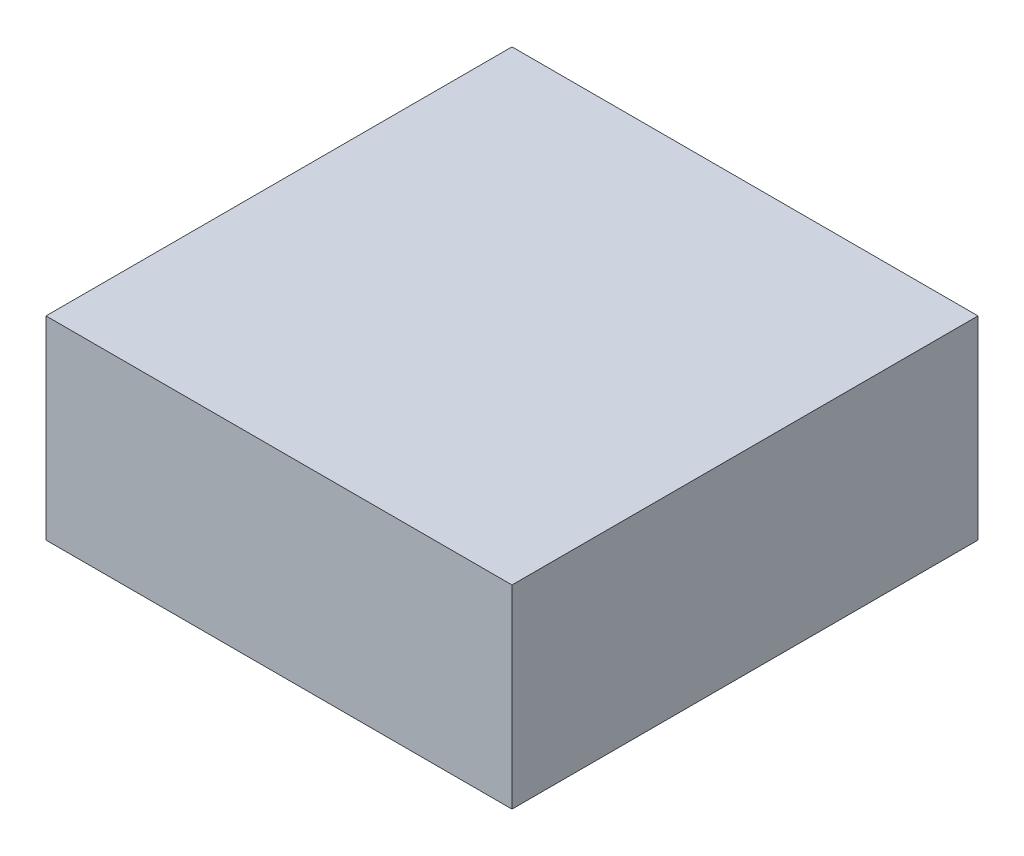
ISO-10303-21;
HEADER;
FILE_DESCRIPTION(('STEP AP214'),'2;1');
FILE_NAME('part.step','',(''),(''),'','','');
FILE_SCHEMA(('AUTOMOTIVE_DESIGN { 1 0 10303 214 1 1 1 1 }'));
ENDSEC;
DATA;
#1=APPLICATION_CONTEXT('core data for automotive mechanical design processes');
#2=APPLICATION_PROTOCOL_DEFINITION('international standard','automotive_design',2000,#1);
#3=PRODUCT_CONTEXT('',#1,'mechanical');
#4=PRODUCT('Part','Part','',(#3));
#5=PRODUCT_RELATED_PRODUCT_CATEGORY('part','',(#4));
#6=PRODUCT_DEFINITION_FORMATION('','',#4);
#7=PRODUCT_DEFINITION_CONTEXT('part definition',#1,'design');
#8=PRODUCT_DEFINITION('design','',#6,#7);
#9=PRODUCT_DEFINITION_SHAPE('','',#8);
#10=(LENGTH_UNIT() NAMED_UNIT(*) SI_UNIT(.MILLI.,.METRE.));
#11=(NAMED_UNIT(*) PLANE_ANGLE_UNIT() SI_UNIT($,.RADIAN.));
#12=(NAMED_UNIT(*) SI_UNIT($,.STERADIAN.) SOLID_ANGLE_UNIT());
#13=UNCERTAINTY_MEASURE_WITH_UNIT(LENGTH_MEASURE(1.E-05),#10,'distance_accuracy_value','');
#14=(GEOMETRIC_REPRESENTATION_CONTEXT(3) GLOBAL_UNCERTAINTY_ASSIGNED_CONTEXT((#13)) GLOBAL_UNIT_ASSIGNED_CONTEXT((#10,
#11,#12)) REPRESENTATION_CONTEXT('',''));
#15=CARTESIAN_POINT('',(0.,0.,0.));
#16=DIRECTION('',(0.,0.,1.));
#17=DIRECTION('',(1.,0.,0.));
#18=AXIS2_PLACEMENT_3D('',#15,#16,#17);
#19=CARTESIAN_POINT('',(600.,500.,600.));
#20=DIRECTION('',(-1.,0.,0.));
#21=DIRECTION('',(0.,0.,1.));
#22=AXIS2_PLACEMENT_3D('',#19,#20,#21);
#23=PLANE('',#22);
#24=DIRECTION('',(0.,0.,-1.));
#25=VECTOR('',#24,1.);
#26=CARTESIAN_POINT('',(600.,0.,600.));
#27=LINE('',#26,#25);
#28=CARTESIAN_POINT('',(600.,0.,600.));
#29=VERTEX_POINT('',#28);
#30=CARTESIAN_POINT('',(600.,0.,-600.));
#31=VERTEX_POINT('',#30);
#32=EDGE_CURVE('E96',#29,#31,#27,.T.);
#33=ORIENTED_EDGE('',*,*,#32,.T.);
#34=DIRECTION('',(0.,-1.,0.));
#35=VECTOR('',#34,1.);
#36=CARTESIAN_POINT('',(600.,500.,-600.));
#37=LINE('',#36,#35);
#38=CARTESIAN_POINT('',(600.,500.,-600.));
#39=VERTEX_POINT('',#38);
#40=EDGE_CURVE('E11',#39,#31,#37,.T.);
#41=ORIENTED_EDGE('',*,*,#40,.F.);
#42=DIRECTION('',(0.,0.,-1.));
#43=VECTOR('',#42,1.);
#44=CARTESIAN_POINT('',(600.,500.,600.));
#45=LINE('',#44,#43);
#46=CARTESIAN_POINT('',(600.,500.,600.));
#47=VERTEX_POINT('',#46);
#48=EDGE_CURVE('E84',#47,#39,#45,.T.);
#49=ORIENTED_EDGE('',*,*,#48,.F.);
#50=DIRECTION('',(0.,-1.,0.));
#51=VECTOR('',#50,1.);
#52=CARTESIAN_POINT('',(600.,500.,600.));
#53=LINE('',#52,#51);
#54=EDGE_CURVE('E92',#47,#29,#53,.T.);
#55=ORIENTED_EDGE('',*,*,#54,.T.);
#56=EDGE_LOOP('',(#33,#41,#49,#55));
#57=FACE_BOUND('',#56,.T.);
#58=ADVANCED_FACE('F33',(#57),#23,.F.);
#59=CARTESIAN_POINT('',(-600.000000000001,500.,-600.));
#60=DIRECTION('',(0.,0.,1.));
#61=DIRECTION('',(1.,0.,0.));
#62=AXIS2_PLACEMENT_3D('',#59,#60,#61);
#63=PLANE('',#62);
#64=DIRECTION('',(-1.,0.,0.));
#65=VECTOR('',#64,1.);
#66=CARTESIAN_POINT('',(-600.000000000001,0.,-600.));
#67=LINE('',#66,#65);
#68=CARTESIAN_POINT('',(-600.000000000001,0.,-600.));
#69=VERTEX_POINT('',#68);
#70=EDGE_CURVE('E88',#31,#69,#67,.T.);
#71=ORIENTED_EDGE('',*,*,#70,.T.);
#72=DIRECTION('',(0.,-1.,0.));
#73=VECTOR('',#72,1.);
#74=CARTESIAN_POINT('',(-600.000000000001,500.,-600.));
#75=LINE('',#74,#73);
#76=CARTESIAN_POINT('',(-600.000000000001,500.,-600.));
#77=VERTEX_POINT('',#76);
#78=EDGE_CURVE('E41',#77,#69,#75,.T.);
#79=ORIENTED_EDGE('',*,*,#78,.F.);
#80=DIRECTION('',(-1.,0.,0.));
#81=VECTOR('',#80,1.);
#82=CARTESIAN_POINT('',(-600.000000000001,500.,-600.));
#83=LINE('',#82,#81);
#84=EDGE_CURVE('E79',#39,#77,#83,.T.);
#85=ORIENTED_EDGE('',*,*,#84,.F.);
#86=ORIENTED_EDGE('',*,*,#40,.T.);
#87=EDGE_LOOP('',(#71,#79,#85,#86));
#88=FACE_BOUND('',#87,.T.);
#89=ADVANCED_FACE('F87',(#88),#63,.F.);
#90=CARTESIAN_POINT('',(-600.000000000001,500.,600.));
#91=DIRECTION('',(1.,0.,0.));
#92=DIRECTION('',(0.,0.,-1.));
#93=AXIS2_PLACEMENT_3D('',#90,#91,#92);
#94=PLANE('',#93);
#95=DIRECTION('',(0.,0.,1.));
#96=VECTOR('',#95,1.);
#97=CARTESIAN_POINT('',(-600.000000000001,0.,600.));
#98=LINE('',#97,#96);
#99=CARTESIAN_POINT('',(-600.000000000001,0.,600.));
#100=VERTEX_POINT('',#99);
#101=EDGE_CURVE('E66',#69,#100,#98,.T.);
#102=ORIENTED_EDGE('',*,*,#101,.T.);
#103=DIRECTION('',(0.,-1.,0.));
#104=VECTOR('',#103,1.);
#105=CARTESIAN_POINT('',(-600.000000000001,500.,600.));
#106=LINE('',#105,#104);
#107=CARTESIAN_POINT('',(-600.000000000001,500.,600.));
#108=VERTEX_POINT('',#107);
#109=EDGE_CURVE('E89',#108,#100,#106,.T.);
#110=ORIENTED_EDGE('',*,*,#109,.F.);
#111=DIRECTION('',(0.,0.,1.));
#112=VECTOR('',#111,1.);
#113=CARTESIAN_POINT('',(-600.000000000001,500.,600.));
#114=LINE('',#113,#112);
#115=EDGE_CURVE('E82',#77,#108,#114,.T.);
#116=ORIENTED_EDGE('',*,*,#115,.F.);
#117=ORIENTED_EDGE('',*,*,#78,.T.);
#118=EDGE_LOOP('',(#102,#110,#116,#117));
#119=FACE_BOUND('',#118,.T.);
#120=ADVANCED_FACE('F90',(#119),#94,.F.);
#121=CARTESIAN_POINT('',(-600.000000000001,500.,600.));
#122=DIRECTION('',(0.,0.,-1.));
#123=DIRECTION('',(-1.,0.,0.));
#124=AXIS2_PLACEMENT_3D('',#121,#122,#123);
#125=PLANE('',#124);
#126=DIRECTION('',(1.,0.,0.));
#127=VECTOR('',#126,1.);
#128=CARTESIAN_POINT('',(-600.000000000001,0.,600.));
#129=LINE('',#128,#127);
#130=EDGE_CURVE('E72',#100,#29,#129,.T.);
#131=ORIENTED_EDGE('',*,*,#130,.T.);
#132=ORIENTED_EDGE('',*,*,#54,.F.);
#133=DIRECTION('',(1.,0.,0.));
#134=VECTOR('',#133,1.);
#135=CARTESIAN_POINT('',(-600.000000000001,500.,600.));
#136=LINE('',#135,#134);
#137=EDGE_CURVE('E49',#108,#47,#136,.T.);
#138=ORIENTED_EDGE('',*,*,#137,.F.);
#139=ORIENTED_EDGE('',*,*,#109,.T.);
#140=EDGE_LOOP('',(#131,#132,#138,#139));
#141=FACE_BOUND('',#140,.T.);
#142=ADVANCED_FACE('F103',(#141),#125,.F.);
#143=CARTESIAN_POINT('',(0.,500.,0.));
#144=DIRECTION('',(0.,-1.,0.));
#145=DIRECTION('',(0.,0.,-1.));
#146=AXIS2_PLACEMENT_3D('',#143,#144,#145);
#147=PLANE('',#146);
#148=ORIENTED_EDGE('',*,*,#48,.T.);
#149=ORIENTED_EDGE('',*,*,#84,.T.);
#150=ORIENTED_EDGE('',*,*,#115,.T.);
#151=ORIENTED_EDGE('',*,*,#137,.T.);
#152=EDGE_LOOP('',(#148,#149,#150,#151));
#153=FACE_BOUND('',#152,.T.);
#154=ADVANCED_FACE('F80',(#153),#147,.F.);
#155=CARTESIAN_POINT('',(0.,0.,0.));
#156=DIRECTION('',(0.,-1.,0.));
#157=DIRECTION('',(0.,0.,-1.));
#158=AXIS2_PLACEMENT_3D('',#155,#156,#157);
#159=PLANE('',#158);
#160=ORIENTED_EDGE('',*,*,#32,.F.);
#161=ORIENTED_EDGE('',*,*,#130,.F.);
#162=ORIENTED_EDGE('',*,*,#101,.F.);
#163=ORIENTED_EDGE('',*,*,#70,.F.);
#164=EDGE_LOOP('',(#160,#161,#162,#163));
#165=FACE_BOUND('',#164,.T.);
#166=ADVANCED_FACE('F106',(#165),#159,.T.);
#167=CLOSED_SHELL('',(#58,#89,#120,#142,#154,#166));
#168=MANIFOLD_SOLID_BREP('B2',#167);
#169=ADVANCED_BREP_SHAPE_REPRESENTATION('',(#18,#168),#14);
#170=SHAPE_DEFINITION_REPRESENTATION(#9,#169);
ENDSEC;
END-ISO-10303-21;
